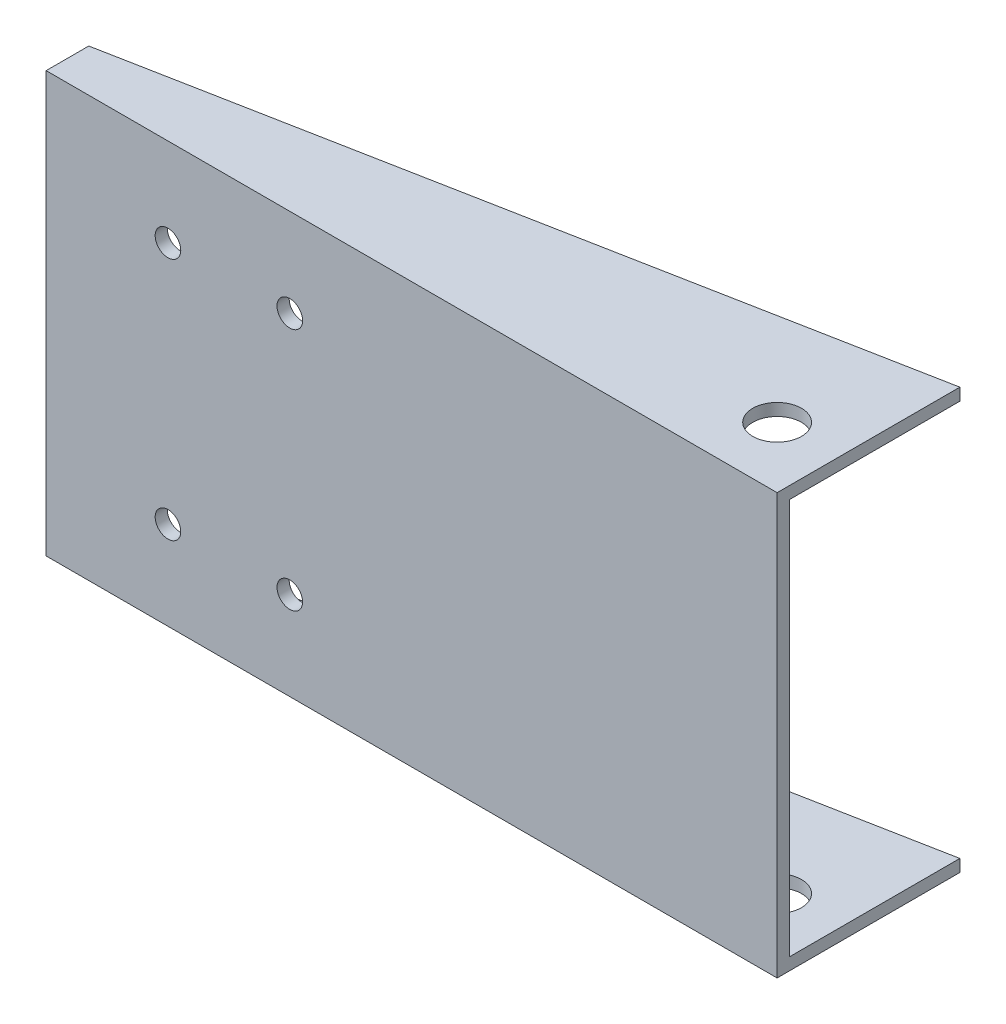
ISO-10303-21;
HEADER;
FILE_DESCRIPTION(('STEP AP214'),'2;1');
FILE_NAME('part.step','',(''),(''),'','','');
FILE_SCHEMA(('AUTOMOTIVE_DESIGN { 1 0 10303 214 1 1 1 1 }'));
ENDSEC;
DATA;
#1=APPLICATION_CONTEXT('core data for automotive mechanical design processes');
#2=APPLICATION_PROTOCOL_DEFINITION('international standard','automotive_design',2000,#1);
#3=PRODUCT_CONTEXT('',#1,'mechanical');
#4=PRODUCT('Part','Part','',(#3));
#5=PRODUCT_RELATED_PRODUCT_CATEGORY('part','',(#4));
#6=PRODUCT_DEFINITION_FORMATION('','',#4);
#7=PRODUCT_DEFINITION_CONTEXT('part definition',#1,'design');
#8=PRODUCT_DEFINITION('design','',#6,#7);
#9=PRODUCT_DEFINITION_SHAPE('','',#8);
#10=(LENGTH_UNIT() NAMED_UNIT(*) SI_UNIT(.MILLI.,.METRE.));
#11=(NAMED_UNIT(*) PLANE_ANGLE_UNIT() SI_UNIT($,.RADIAN.));
#12=(NAMED_UNIT(*) SI_UNIT($,.STERADIAN.) SOLID_ANGLE_UNIT());
#13=UNCERTAINTY_MEASURE_WITH_UNIT(LENGTH_MEASURE(1.E-05),#10,'distance_accuracy_value','');
#14=(GEOMETRIC_REPRESENTATION_CONTEXT(3) GLOBAL_UNCERTAINTY_ASSIGNED_CONTEXT((#13)) GLOBAL_UNIT_ASSIGNED_CONTEXT((#10,
#11,#12)) REPRESENTATION_CONTEXT('',''));
#15=CARTESIAN_POINT('',(0.,0.,0.));
#16=DIRECTION('',(0.,0.,1.));
#17=DIRECTION('',(1.,0.,0.));
#18=AXIS2_PLACEMENT_3D('',#15,#16,#17);
#19=CARTESIAN_POINT('',(-35.0052521613522,93.2782642015194,2.));
#20=DIRECTION('',(1.,0.,0.));
#21=DIRECTION('',(0.,1.,0.));
#22=AXIS2_PLACEMENT_3D('',#19,#20,#21);
#23=PLANE('',#22);
#24=DIRECTION('',(0.,-1.,0.));
#25=VECTOR('',#24,1.);
#26=CARTESIAN_POINT('',(-35.0052521613522,93.2782642015194,0.));
#27=LINE('',#26,#25);
#28=CARTESIAN_POINT('',(-35.0052521613522,93.2782642015194,0.));
#29=VERTEX_POINT('',#28);
#30=CARTESIAN_POINT('',(-35.0052521613522,28.2782642015194,0.));
#31=VERTEX_POINT('',#30);
#32=EDGE_CURVE('E159',#29,#31,#27,.T.);
#33=ORIENTED_EDGE('',*,*,#32,.T.);
#34=DIRECTION('',(0.,0.,-1.));
#35=VECTOR('',#34,1.);
#36=CARTESIAN_POINT('',(-35.0052521613522,28.2782642015194,0.));
#37=LINE('',#36,#35);
#38=CARTESIAN_POINT('',(-35.0052521613522,28.2782642015194,-5.));
#39=VERTEX_POINT('',#38);
#40=EDGE_CURVE('E140',#31,#39,#37,.T.);
#41=ORIENTED_EDGE('',*,*,#40,.T.);
#42=DIRECTION('',(0.,1.,0.));
#43=VECTOR('',#42,1.);
#44=CARTESIAN_POINT('',(-35.0052521613522,26.2782642015194,-5.));
#45=LINE('',#44,#43);
#46=CARTESIAN_POINT('',(-35.0052521613522,26.2782642015194,-5.));
#47=VERTEX_POINT('',#46);
#48=EDGE_CURVE('E156',#47,#39,#45,.T.);
#49=ORIENTED_EDGE('',*,*,#48,.F.);
#50=DIRECTION('',(0.,0.,-1.));
#51=VECTOR('',#50,1.);
#52=CARTESIAN_POINT('',(-35.0052521613522,26.2782642015194,2.));
#53=LINE('',#52,#51);
#54=CARTESIAN_POINT('',(-35.0052521613522,26.2782642015194,2.));
#55=VERTEX_POINT('',#54);
#56=EDGE_CURVE('E142',#55,#47,#53,.T.);
#57=ORIENTED_EDGE('',*,*,#56,.F.);
#58=DIRECTION('',(0.,-1.,0.));
#59=VECTOR('',#58,1.);
#60=CARTESIAN_POINT('',(-35.0052521613522,93.2782642015194,2.));
#61=LINE('',#60,#59);
#62=CARTESIAN_POINT('',(-35.0052521613522,95.2782642015194,2.));
#63=VERTEX_POINT('',#62);
#64=EDGE_CURVE('E43',#63,#55,#61,.T.);
#65=ORIENTED_EDGE('',*,*,#64,.F.);
#66=DIRECTION('',(0.,0.,-1.));
#67=VECTOR('',#66,1.);
#68=CARTESIAN_POINT('',(-35.0052521613522,95.2782642015194,0.));
#69=LINE('',#68,#67);
#70=CARTESIAN_POINT('',(-35.0052521613522,95.2782642015194,-5.));
#71=VERTEX_POINT('',#70);
#72=EDGE_CURVE('E117',#63,#71,#69,.T.);
#73=ORIENTED_EDGE('',*,*,#72,.T.);
#74=DIRECTION('',(0.,-1.,0.));
#75=VECTOR('',#74,1.);
#76=CARTESIAN_POINT('',(-35.0052521613522,95.2782642015194,-5.));
#77=LINE('',#76,#75);
#78=CARTESIAN_POINT('',(-35.0052521613522,93.2782642015194,-5.));
#79=VERTEX_POINT('',#78);
#80=EDGE_CURVE('E128',#71,#79,#77,.T.);
#81=ORIENTED_EDGE('',*,*,#80,.T.);
#82=DIRECTION('',(0.,0.,-1.));
#83=VECTOR('',#82,1.);
#84=CARTESIAN_POINT('',(-35.0052521613522,93.2782642015194,2.));
#85=LINE('',#84,#83);
#86=EDGE_CURVE('E118',#29,#79,#85,.T.);
#87=ORIENTED_EDGE('',*,*,#86,.F.);
#88=EDGE_LOOP('',(#33,#41,#49,#57,#65,#73,#81,#87));
#89=FACE_BOUND('',#88,.T.);
#90=ADVANCED_FACE('F35',(#89),#23,.F.);
#91=CARTESIAN_POINT('',(84.9947478386478,28.2782642015194,2.));
#92=DIRECTION('',(-1.,0.,0.));
#93=DIRECTION('',(0.,0.,1.));
#94=AXIS2_PLACEMENT_3D('',#91,#92,#93);
#95=PLANE('',#94);
#96=DIRECTION('',(0.,1.,0.));
#97=VECTOR('',#96,1.);
#98=CARTESIAN_POINT('',(84.9947478386478,28.2782642015194,0.));
#99=LINE('',#98,#97);
#100=CARTESIAN_POINT('',(84.9947478386478,28.2782642015194,0.));
#101=VERTEX_POINT('',#100);
#102=CARTESIAN_POINT('',(84.9947478386478,93.2782642015194,0.));
#103=VERTEX_POINT('',#102);
#104=EDGE_CURVE('E51',#101,#103,#99,.T.);
#105=ORIENTED_EDGE('',*,*,#104,.T.);
#106=DIRECTION('',(0.,0.,1.));
#107=VECTOR('',#106,1.);
#108=CARTESIAN_POINT('',(84.9947478386478,93.2782642015194,2.));
#109=LINE('',#108,#107);
#110=CARTESIAN_POINT('',(84.9947478386478,93.2782642015194,-28.));
#111=VERTEX_POINT('',#110);
#112=EDGE_CURVE('E129',#111,#103,#109,.T.);
#113=ORIENTED_EDGE('',*,*,#112,.F.);
#114=DIRECTION('',(0.,-1.,0.));
#115=VECTOR('',#114,1.);
#116=CARTESIAN_POINT('',(84.9947478386478,95.2782642015194,-28.));
#117=LINE('',#116,#115);
#118=CARTESIAN_POINT('',(84.9947478386478,95.2782642015194,-28.));
#119=VERTEX_POINT('',#118);
#120=EDGE_CURVE('E121',#119,#111,#117,.T.);
#121=ORIENTED_EDGE('',*,*,#120,.F.);
#122=DIRECTION('',(0.,0.,1.));
#123=VECTOR('',#122,1.);
#124=CARTESIAN_POINT('',(84.9947478386478,95.2782642015194,2.));
#125=LINE('',#124,#123);
#126=CARTESIAN_POINT('',(84.9947478386478,95.2782642015194,2.));
#127=VERTEX_POINT('',#126);
#128=EDGE_CURVE('E114',#119,#127,#125,.T.);
#129=ORIENTED_EDGE('',*,*,#128,.T.);
#130=DIRECTION('',(0.,1.,0.));
#131=VECTOR('',#130,1.);
#132=CARTESIAN_POINT('',(84.9947478386478,28.2782642015194,2.));
#133=LINE('',#132,#131);
#134=CARTESIAN_POINT('',(84.9947478386478,26.2782642015194,2.));
#135=VERTEX_POINT('',#134);
#136=EDGE_CURVE('E11',#135,#127,#133,.T.);
#137=ORIENTED_EDGE('',*,*,#136,.F.);
#138=DIRECTION('',(0.,0.,1.));
#139=VECTOR('',#138,1.);
#140=CARTESIAN_POINT('',(84.9947478386478,26.2782642015194,2.));
#141=LINE('',#140,#139);
#142=CARTESIAN_POINT('',(84.9947478386478,26.2782642015194,-28.));
#143=VERTEX_POINT('',#142);
#144=EDGE_CURVE('E147',#143,#135,#141,.T.);
#145=ORIENTED_EDGE('',*,*,#144,.F.);
#146=DIRECTION('',(0.,1.,0.));
#147=VECTOR('',#146,1.);
#148=CARTESIAN_POINT('',(84.9947478386478,26.2782642015194,-28.));
#149=LINE('',#148,#147);
#150=CARTESIAN_POINT('',(84.9947478386478,28.2782642015194,-28.));
#151=VERTEX_POINT('',#150);
#152=EDGE_CURVE('E149',#143,#151,#149,.T.);
#153=ORIENTED_EDGE('',*,*,#152,.T.);
#154=DIRECTION('',(0.,0.,1.));
#155=VECTOR('',#154,1.);
#156=CARTESIAN_POINT('',(84.9947478386478,28.2782642015194,2.));
#157=LINE('',#156,#155);
#158=EDGE_CURVE('E143',#151,#101,#157,.T.);
#159=ORIENTED_EDGE('',*,*,#158,.T.);
#160=EDGE_LOOP('',(#105,#113,#121,#129,#137,#145,#153,#159));
#161=FACE_BOUND('',#160,.T.);
#162=ADVANCED_FACE('F120',(#161),#95,.F.);
#163=CARTESIAN_POINT('',(0.,0.,2.));
#164=DIRECTION('',(0.,0.,1.));
#165=DIRECTION('',(1.,0.,0.));
#166=AXIS2_PLACEMENT_3D('',#163,#164,#165);
#167=PLANE('',#166);
#168=CARTESIAN_POINT('',(4.99474783864779,80.7782642015194,2.));
#169=DIRECTION('',(0.,0.,1.));
#170=DIRECTION('',(1.,0.,0.));
#171=AXIS2_PLACEMENT_3D('',#168,#169,#170);
#172=CIRCLE('',#171,2.1);
#173=CARTESIAN_POINT('',(7.0947478386478,80.7782642015194,2.));
#174=VERTEX_POINT('',#173);
#175=EDGE_CURVE('E240',#174,#174,#172,.T.);
#176=ORIENTED_EDGE('',*,*,#175,.F.);
#177=EDGE_LOOP('',(#176));
#178=FACE_BOUND('',#177,.T.);
#179=CARTESIAN_POINT('',(-15.0052521613522,40.7782642015194,2.));
#180=DIRECTION('',(0.,0.,1.));
#181=DIRECTION('',(-1.,0.,0.));
#182=AXIS2_PLACEMENT_3D('',#179,#180,#181);
#183=CIRCLE('',#182,2.1);
#184=CARTESIAN_POINT('',(-17.1052521613522,40.7782642015194,2.));
#185=VERTEX_POINT('',#184);
#186=EDGE_CURVE('E233',#185,#185,#183,.T.);
#187=ORIENTED_EDGE('',*,*,#186,.F.);
#188=EDGE_LOOP('',(#187));
#189=FACE_BOUND('',#188,.T.);
#190=CARTESIAN_POINT('',(4.99474783864779,40.7782642015194,2.));
#191=DIRECTION('',(0.,0.,1.));
#192=DIRECTION('',(-1.,0.,0.));
#193=AXIS2_PLACEMENT_3D('',#190,#191,#192);
#194=CIRCLE('',#193,2.1);
#195=CARTESIAN_POINT('',(2.8947478386478,40.7782642015194,2.));
#196=VERTEX_POINT('',#195);
#197=EDGE_CURVE('E229',#196,#196,#194,.T.);
#198=ORIENTED_EDGE('',*,*,#197,.F.);
#199=EDGE_LOOP('',(#198));
#200=FACE_BOUND('',#199,.T.);
#201=CARTESIAN_POINT('',(-15.0052521613522,80.7782642015194,2.));
#202=DIRECTION('',(0.,0.,1.));
#203=DIRECTION('',(1.,0.,0.));
#204=AXIS2_PLACEMENT_3D('',#201,#202,#203);
#205=CIRCLE('',#204,2.1);
#206=CARTESIAN_POINT('',(-12.9052521613522,80.7782642015194,2.));
#207=VERTEX_POINT('',#206);
#208=EDGE_CURVE('E239',#207,#207,#205,.T.);
#209=ORIENTED_EDGE('',*,*,#208,.F.);
#210=EDGE_LOOP('',(#209));
#211=FACE_BOUND('',#210,.T.);
#212=ORIENTED_EDGE('',*,*,#64,.T.);
#213=DIRECTION('',(-1.,0.,0.));
#214=VECTOR('',#213,1.);
#215=CARTESIAN_POINT('',(-35.0052521613522,26.2782642015194,2.));
#216=LINE('',#215,#214);
#217=EDGE_CURVE('E105',#135,#55,#216,.T.);
#218=ORIENTED_EDGE('',*,*,#217,.F.);
#219=ORIENTED_EDGE('',*,*,#136,.T.);
#220=DIRECTION('',(-1.,0.,0.));
#221=VECTOR('',#220,1.);
#222=CARTESIAN_POINT('',(-35.0052521613522,95.2782642015194,2.));
#223=LINE('',#222,#221);
#224=EDGE_CURVE('E103',#127,#63,#223,.T.);
#225=ORIENTED_EDGE('',*,*,#224,.T.);
#226=EDGE_LOOP('',(#212,#218,#219,#225));
#227=FACE_BOUND('',#226,.T.);
#228=ADVANCED_FACE('F102',(#178,#189,#200,#211,#227),#167,.T.);
#229=CARTESIAN_POINT('',(0.,0.,0.));
#230=DIRECTION('',(0.,0.,1.));
#231=DIRECTION('',(1.,0.,0.));
#232=AXIS2_PLACEMENT_3D('',#229,#230,#231);
#233=PLANE('',#232);
#234=CARTESIAN_POINT('',(4.99474783864779,80.7782642015194,0.));
#235=DIRECTION('',(0.,0.,1.));
#236=DIRECTION('',(1.,0.,0.));
#237=AXIS2_PLACEMENT_3D('',#234,#235,#236);
#238=CIRCLE('',#237,2.1);
#239=CARTESIAN_POINT('',(7.0947478386478,80.7782642015194,0.));
#240=VERTEX_POINT('',#239);
#241=EDGE_CURVE('E236',#240,#240,#238,.T.);
#242=ORIENTED_EDGE('',*,*,#241,.T.);
#243=EDGE_LOOP('',(#242));
#244=FACE_BOUND('',#243,.T.);
#245=CARTESIAN_POINT('',(-15.0052521613522,40.7782642015194,0.));
#246=DIRECTION('',(0.,0.,1.));
#247=DIRECTION('',(-1.,0.,0.));
#248=AXIS2_PLACEMENT_3D('',#245,#246,#247);
#249=CIRCLE('',#248,2.1);
#250=CARTESIAN_POINT('',(-17.1052521613522,40.7782642015194,0.));
#251=VERTEX_POINT('',#250);
#252=EDGE_CURVE('E243',#251,#251,#249,.T.);
#253=ORIENTED_EDGE('',*,*,#252,.T.);
#254=EDGE_LOOP('',(#253));
#255=FACE_BOUND('',#254,.T.);
#256=CARTESIAN_POINT('',(4.99474783864779,40.7782642015194,0.));
#257=DIRECTION('',(0.,0.,1.));
#258=DIRECTION('',(-1.,0.,0.));
#259=AXIS2_PLACEMENT_3D('',#256,#257,#258);
#260=CIRCLE('',#259,2.1);
#261=CARTESIAN_POINT('',(2.8947478386478,40.7782642015194,0.));
#262=VERTEX_POINT('',#261);
#263=EDGE_CURVE('E230',#262,#262,#260,.T.);
#264=ORIENTED_EDGE('',*,*,#263,.T.);
#265=EDGE_LOOP('',(#264));
#266=FACE_BOUND('',#265,.T.);
#267=CARTESIAN_POINT('',(-15.0052521613522,80.7782642015194,0.));
#268=DIRECTION('',(0.,0.,1.));
#269=DIRECTION('',(1.,0.,0.));
#270=AXIS2_PLACEMENT_3D('',#267,#268,#269);
#271=CIRCLE('',#270,2.1);
#272=CARTESIAN_POINT('',(-12.9052521613522,80.7782642015194,0.));
#273=VERTEX_POINT('',#272);
#274=EDGE_CURVE('E133',#273,#273,#271,.T.);
#275=ORIENTED_EDGE('',*,*,#274,.T.);
#276=EDGE_LOOP('',(#275));
#277=FACE_BOUND('',#276,.T.);
#278=ORIENTED_EDGE('',*,*,#32,.F.);
#279=DIRECTION('',(-1.,0.,0.));
#280=VECTOR('',#279,1.);
#281=CARTESIAN_POINT('',(84.9947478386478,93.2782642015194,0.));
#282=LINE('',#281,#280);
#283=EDGE_CURVE('E160',#103,#29,#282,.T.);
#284=ORIENTED_EDGE('',*,*,#283,.F.);
#285=ORIENTED_EDGE('',*,*,#104,.F.);
#286=DIRECTION('',(1.,0.,0.));
#287=VECTOR('',#286,1.);
#288=CARTESIAN_POINT('',(-35.0052521613522,28.2782642015194,0.));
#289=LINE('',#288,#287);
#290=EDGE_CURVE('E58',#31,#101,#289,.T.);
#291=ORIENTED_EDGE('',*,*,#290,.F.);
#292=EDGE_LOOP('',(#278,#284,#285,#291));
#293=FACE_BOUND('',#292,.T.);
#294=ADVANCED_FACE('F194',(#244,#255,#266,#277,#293),#233,.F.);
#295=CARTESIAN_POINT('',(84.9947478386478,26.2782642015194,-28.));
#296=DIRECTION('',(0.188240243952682,0.,0.982123011927037));
#297=DIRECTION('',(0.982123011927037,0.,-0.188240243952682));
#298=AXIS2_PLACEMENT_3D('',#295,#296,#297);
#299=PLANE('',#298);
#300=DIRECTION('',(0.982123011927037,0.,-0.188240243952682));
#301=VECTOR('',#300,1.);
#302=CARTESIAN_POINT('',(84.9947478386478,28.2782642015194,-28.));
#303=LINE('',#302,#301);
#304=EDGE_CURVE('E151',#39,#151,#303,.T.);
#305=ORIENTED_EDGE('',*,*,#304,.T.);
#306=ORIENTED_EDGE('',*,*,#152,.F.);
#307=DIRECTION('',(0.982123011927037,0.,-0.188240243952682));
#308=VECTOR('',#307,1.);
#309=CARTESIAN_POINT('',(84.9947478386478,26.2782642015194,-28.));
#310=LINE('',#309,#308);
#311=EDGE_CURVE('E145',#47,#143,#310,.T.);
#312=ORIENTED_EDGE('',*,*,#311,.F.);
#313=ORIENTED_EDGE('',*,*,#48,.T.);
#314=EDGE_LOOP('',(#305,#306,#312,#313));
#315=FACE_BOUND('',#314,.T.);
#316=ADVANCED_FACE('F199',(#315),#299,.F.);
#317=CARTESIAN_POINT('',(0.,26.2782642015194,0.));
#318=DIRECTION('',(0.,1.,0.));
#319=DIRECTION('',(0.,0.,1.));
#320=AXIS2_PLACEMENT_3D('',#317,#318,#319);
#321=PLANE('',#320);
#322=CARTESIAN_POINT('',(74.9947478386478,26.2782642015194,-8.));
#323=DIRECTION('',(0.,-1.,0.));
#324=DIRECTION('',(0.,0.,-1.));
#325=AXIS2_PLACEMENT_3D('',#322,#323,#324);
#326=CIRCLE('',#325,4.00000000000001);
#327=CARTESIAN_POINT('',(74.9947478386478,26.2782642015194,-12.));
#328=VERTEX_POINT('',#327);
#329=EDGE_CURVE('E211',#328,#328,#326,.T.);
#330=ORIENTED_EDGE('',*,*,#329,.F.);
#331=EDGE_LOOP('',(#330));
#332=FACE_BOUND('',#331,.T.);
#333=ORIENTED_EDGE('',*,*,#217,.T.);
#334=ORIENTED_EDGE('',*,*,#56,.T.);
#335=ORIENTED_EDGE('',*,*,#311,.T.);
#336=ORIENTED_EDGE('',*,*,#144,.T.);
#337=EDGE_LOOP('',(#333,#334,#335,#336));
#338=FACE_BOUND('',#337,.T.);
#339=ADVANCED_FACE('F182',(#332,#338),#321,.F.);
#340=CARTESIAN_POINT('',(0.,28.2782642015194,0.));
#341=DIRECTION('',(0.,1.,0.));
#342=DIRECTION('',(0.,0.,1.));
#343=AXIS2_PLACEMENT_3D('',#340,#341,#342);
#344=PLANE('',#343);
#345=CARTESIAN_POINT('',(74.9947478386478,28.2782642015194,-8.));
#346=DIRECTION('',(0.,1.,0.));
#347=DIRECTION('',(0.,0.,1.));
#348=AXIS2_PLACEMENT_3D('',#345,#346,#347);
#349=CIRCLE('',#348,4.00000000000001);
#350=CARTESIAN_POINT('',(74.9947478386478,28.2782642015194,-3.99999999999999));
#351=VERTEX_POINT('',#350);
#352=EDGE_CURVE('E226',#351,#351,#349,.T.);
#353=ORIENTED_EDGE('',*,*,#352,.F.);
#354=EDGE_LOOP('',(#353));
#355=FACE_BOUND('',#354,.T.);
#356=ORIENTED_EDGE('',*,*,#40,.F.);
#357=ORIENTED_EDGE('',*,*,#290,.T.);
#358=ORIENTED_EDGE('',*,*,#158,.F.);
#359=ORIENTED_EDGE('',*,*,#304,.F.);
#360=EDGE_LOOP('',(#356,#357,#358,#359));
#361=FACE_BOUND('',#360,.T.);
#362=ADVANCED_FACE('F174',(#355,#361),#344,.T.);
#363=CARTESIAN_POINT('',(84.9947478386478,95.2782642015194,-28.));
#364=DIRECTION('',(-0.188240243952682,0.,-0.982123011927037));
#365=DIRECTION('',(-0.982123011927037,0.,0.188240243952682));
#366=AXIS2_PLACEMENT_3D('',#363,#364,#365);
#367=PLANE('',#366);
#368=DIRECTION('',(0.982123011927037,0.,-0.188240243952682));
#369=VECTOR('',#368,1.);
#370=CARTESIAN_POINT('',(84.9947478386478,93.2782642015194,-28.));
#371=LINE('',#370,#369);
#372=EDGE_CURVE('E132',#79,#111,#371,.T.);
#373=ORIENTED_EDGE('',*,*,#372,.F.);
#374=ORIENTED_EDGE('',*,*,#80,.F.);
#375=DIRECTION('',(0.982123011927037,0.,-0.188240243952682));
#376=VECTOR('',#375,1.);
#377=CARTESIAN_POINT('',(84.9947478386478,95.2782642015194,-28.));
#378=LINE('',#377,#376);
#379=EDGE_CURVE('E122',#71,#119,#378,.T.);
#380=ORIENTED_EDGE('',*,*,#379,.T.);
#381=ORIENTED_EDGE('',*,*,#120,.T.);
#382=EDGE_LOOP('',(#373,#374,#380,#381));
#383=FACE_BOUND('',#382,.T.);
#384=ADVANCED_FACE('F172',(#383),#367,.T.);
#385=CARTESIAN_POINT('',(0.,95.2782642015194,0.));
#386=DIRECTION('',(0.,-1.,0.));
#387=DIRECTION('',(0.,0.,1.));
#388=AXIS2_PLACEMENT_3D('',#385,#386,#387);
#389=PLANE('',#388);
#390=CARTESIAN_POINT('',(74.9947478386478,95.2782642015194,-8.));
#391=DIRECTION('',(0.,-1.,0.));
#392=DIRECTION('',(0.,0.,-1.));
#393=AXIS2_PLACEMENT_3D('',#390,#391,#392);
#394=CIRCLE('',#393,4.00000000000001);
#395=CARTESIAN_POINT('',(74.9947478386478,95.2782642015194,-12.));
#396=VERTEX_POINT('',#395);
#397=EDGE_CURVE('E222',#396,#396,#394,.T.);
#398=ORIENTED_EDGE('',*,*,#397,.T.);
#399=EDGE_LOOP('',(#398));
#400=FACE_BOUND('',#399,.T.);
#401=ORIENTED_EDGE('',*,*,#224,.F.);
#402=ORIENTED_EDGE('',*,*,#128,.F.);
#403=ORIENTED_EDGE('',*,*,#379,.F.);
#404=ORIENTED_EDGE('',*,*,#72,.F.);
#405=EDGE_LOOP('',(#401,#402,#403,#404));
#406=FACE_BOUND('',#405,.T.);
#407=ADVANCED_FACE('F112',(#400,#406),#389,.F.);
#408=CARTESIAN_POINT('',(0.,93.2782642015194,0.));
#409=DIRECTION('',(0.,-1.,0.));
#410=DIRECTION('',(0.,0.,1.));
#411=AXIS2_PLACEMENT_3D('',#408,#409,#410);
#412=PLANE('',#411);
#413=CARTESIAN_POINT('',(74.9947478386478,93.2782642015194,-8.));
#414=DIRECTION('',(0.,-1.,0.));
#415=DIRECTION('',(0.,0.,-1.));
#416=AXIS2_PLACEMENT_3D('',#413,#414,#415);
#417=CIRCLE('',#416,4.00000000000001);
#418=CARTESIAN_POINT('',(74.9947478386478,93.2782642015194,-12.));
#419=VERTEX_POINT('',#418);
#420=EDGE_CURVE('E38',#419,#419,#417,.T.);
#421=ORIENTED_EDGE('',*,*,#420,.F.);
#422=EDGE_LOOP('',(#421));
#423=FACE_BOUND('',#422,.T.);
#424=ORIENTED_EDGE('',*,*,#112,.T.);
#425=ORIENTED_EDGE('',*,*,#283,.T.);
#426=ORIENTED_EDGE('',*,*,#86,.T.);
#427=ORIENTED_EDGE('',*,*,#372,.T.);
#428=EDGE_LOOP('',(#424,#425,#426,#427));
#429=FACE_BOUND('',#428,.T.);
#430=ADVANCED_FACE('F167',(#423,#429),#412,.T.);
#431=CARTESIAN_POINT('',(-15.0052521613522,80.7782642015194,0.));
#432=DIRECTION('',(0.,0.,1.));
#433=DIRECTION('',(1.,0.,0.));
#434=AXIS2_PLACEMENT_3D('',#431,#432,#433);
#435=CYLINDRICAL_SURFACE('',#434,2.1);
#436=ORIENTED_EDGE('',*,*,#274,.F.);
#437=EDGE_LOOP('',(#436));
#438=FACE_BOUND('',#437,.T.);
#439=ORIENTED_EDGE('',*,*,#208,.T.);
#440=EDGE_LOOP('',(#439));
#441=FACE_BOUND('',#440,.T.);
#442=ADVANCED_FACE('F252',(#438,#441),#435,.F.);
#443=CARTESIAN_POINT('',(4.99474783864779,40.7782642015194,0.));
#444=DIRECTION('',(0.,0.,1.));
#445=DIRECTION('',(1.,0.,0.));
#446=AXIS2_PLACEMENT_3D('',#443,#444,#445);
#447=CYLINDRICAL_SURFACE('',#446,2.1);
#448=ORIENTED_EDGE('',*,*,#263,.F.);
#449=EDGE_LOOP('',(#448));
#450=FACE_BOUND('',#449,.T.);
#451=ORIENTED_EDGE('',*,*,#197,.T.);
#452=EDGE_LOOP('',(#451));
#453=FACE_BOUND('',#452,.T.);
#454=ADVANCED_FACE('F255',(#450,#453),#447,.F.);
#455=CARTESIAN_POINT('',(-15.0052521613522,40.7782642015194,0.));
#456=DIRECTION('',(0.,0.,1.));
#457=DIRECTION('',(1.,0.,0.));
#458=AXIS2_PLACEMENT_3D('',#455,#456,#457);
#459=CYLINDRICAL_SURFACE('',#458,2.1);
#460=ORIENTED_EDGE('',*,*,#252,.F.);
#461=EDGE_LOOP('',(#460));
#462=FACE_BOUND('',#461,.T.);
#463=ORIENTED_EDGE('',*,*,#186,.T.);
#464=EDGE_LOOP('',(#463));
#465=FACE_BOUND('',#464,.T.);
#466=ADVANCED_FACE('F262',(#462,#465),#459,.F.);
#467=CARTESIAN_POINT('',(4.99474783864779,80.7782642015194,0.));
#468=DIRECTION('',(0.,0.,1.));
#469=DIRECTION('',(1.,0.,0.));
#470=AXIS2_PLACEMENT_3D('',#467,#468,#469);
#471=CYLINDRICAL_SURFACE('',#470,2.1);
#472=ORIENTED_EDGE('',*,*,#241,.F.);
#473=EDGE_LOOP('',(#472));
#474=FACE_BOUND('',#473,.T.);
#475=ORIENTED_EDGE('',*,*,#175,.T.);
#476=EDGE_LOOP('',(#475));
#477=FACE_BOUND('',#476,.T.);
#478=ADVANCED_FACE('F270',(#474,#477),#471,.F.);
#479=CARTESIAN_POINT('',(74.9947478386478,96.2782642015194,-8.));
#480=DIRECTION('',(0.,-1.,0.));
#481=DIRECTION('',(0.,0.,-1.));
#482=AXIS2_PLACEMENT_3D('',#479,#480,#481);
#483=CYLINDRICAL_SURFACE('',#482,4.00000000000001);
#484=ORIENTED_EDGE('',*,*,#420,.T.);
#485=EDGE_LOOP('',(#484));
#486=FACE_BOUND('',#485,.T.);
#487=ORIENTED_EDGE('',*,*,#397,.F.);
#488=EDGE_LOOP('',(#487));
#489=FACE_BOUND('',#488,.T.);
#490=ADVANCED_FACE('F273',(#486,#489),#483,.F.);
#491=ORIENTED_EDGE('',*,*,#352,.T.);
#492=EDGE_LOOP('',(#491));
#493=FACE_BOUND('',#492,.T.);
#494=ORIENTED_EDGE('',*,*,#329,.T.);
#495=EDGE_LOOP('',(#494));
#496=FACE_BOUND('',#495,.T.);
#497=ADVANCED_FACE('F277',(#493,#496),#483,.F.);
#498=CLOSED_SHELL('',(#90,#162,#228,#294,#316,#339,#362,#384,#407,#430,#442,#454,#466,#478,#490,#497));
#499=MANIFOLD_SOLID_BREP('B2',#498);
#500=ADVANCED_BREP_SHAPE_REPRESENTATION('',(#18,#499),#14);
#501=SHAPE_DEFINITION_REPRESENTATION(#9,#500);
ENDSEC;
END-ISO-10303-21;
